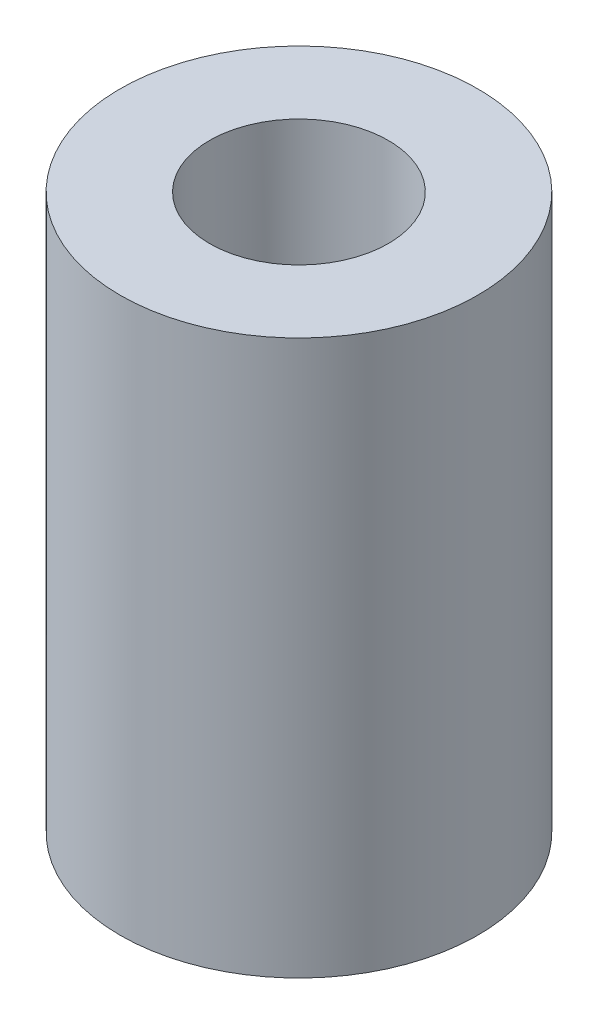
ISO-10303-21;
HEADER;
FILE_DESCRIPTION(('STEP AP214'),'2;1');
FILE_NAME('part.step','',(''),(''),'','','');
FILE_SCHEMA(('AUTOMOTIVE_DESIGN { 1 0 10303 214 1 1 1 1 }'));
ENDSEC;
DATA;
#1=APPLICATION_CONTEXT('core data for automotive mechanical design processes');
#2=APPLICATION_PROTOCOL_DEFINITION('international standard','automotive_design',2000,#1);
#3=PRODUCT_CONTEXT('',#1,'mechanical');
#4=PRODUCT('Part','Part','',(#3));
#5=PRODUCT_RELATED_PRODUCT_CATEGORY('part','',(#4));
#6=PRODUCT_DEFINITION_FORMATION('','',#4);
#7=PRODUCT_DEFINITION_CONTEXT('part definition',#1,'design');
#8=PRODUCT_DEFINITION('design','',#6,#7);
#9=PRODUCT_DEFINITION_SHAPE('','',#8);
#10=(LENGTH_UNIT() NAMED_UNIT(*) SI_UNIT(.MILLI.,.METRE.));
#11=(NAMED_UNIT(*) PLANE_ANGLE_UNIT() SI_UNIT($,.RADIAN.));
#12=(NAMED_UNIT(*) SI_UNIT($,.STERADIAN.) SOLID_ANGLE_UNIT());
#13=UNCERTAINTY_MEASURE_WITH_UNIT(LENGTH_MEASURE(1.E-05),#10,'distance_accuracy_value','');
#14=(GEOMETRIC_REPRESENTATION_CONTEXT(3) GLOBAL_UNCERTAINTY_ASSIGNED_CONTEXT((#13)) GLOBAL_UNIT_ASSIGNED_CONTEXT((#10,
#11,#12)) REPRESENTATION_CONTEXT('',''));
#15=CARTESIAN_POINT('',(0.,0.,0.));
#16=DIRECTION('',(0.,0.,1.));
#17=DIRECTION('',(1.,0.,0.));
#18=AXIS2_PLACEMENT_3D('',#15,#16,#17);
#19=CARTESIAN_POINT('',(0.,15.5,0.));
#20=DIRECTION('',(0.,1.,0.));
#21=DIRECTION('',(0.,0.,1.));
#22=AXIS2_PLACEMENT_3D('',#19,#20,#21);
#23=PLANE('',#22);
#24=CARTESIAN_POINT('',(0.,15.5,0.));
#25=DIRECTION('',(0.,1.,0.));
#26=DIRECTION('',(0.,0.,1.));
#27=AXIS2_PLACEMENT_3D('',#24,#25,#26);
#28=CIRCLE('',#27,5.);
#29=CARTESIAN_POINT('',(0.,15.5,5.));
#30=VERTEX_POINT('',#29);
#31=EDGE_CURVE('E10',#30,#30,#28,.T.);
#32=ORIENTED_EDGE('',*,*,#31,.T.);
#33=EDGE_LOOP('',(#32));
#34=FACE_BOUND('',#33,.T.);
#35=CARTESIAN_POINT('',(0.,15.5,0.));
#36=DIRECTION('',(0.,1.,0.));
#37=DIRECTION('',(0.,0.,1.));
#38=AXIS2_PLACEMENT_3D('',#35,#36,#37);
#39=CIRCLE('',#38,2.5);
#40=CARTESIAN_POINT('',(0.,15.5,2.5));
#41=VERTEX_POINT('',#40);
#42=EDGE_CURVE('E64',#41,#41,#39,.T.);
#43=ORIENTED_EDGE('',*,*,#42,.F.);
#44=EDGE_LOOP('',(#43));
#45=FACE_BOUND('',#44,.T.);
#46=ADVANCED_FACE('F43',(#34,#45),#23,.T.);
#47=CARTESIAN_POINT('',(0.,0.,0.));
#48=DIRECTION('',(0.,1.,0.));
#49=DIRECTION('',(0.,0.,1.));
#50=AXIS2_PLACEMENT_3D('',#47,#48,#49);
#51=PLANE('',#50);
#52=CARTESIAN_POINT('',(0.,0.,0.));
#53=DIRECTION('',(0.,1.,0.));
#54=DIRECTION('',(0.,0.,1.));
#55=AXIS2_PLACEMENT_3D('',#52,#53,#54);
#56=CIRCLE('',#55,5.);
#57=CARTESIAN_POINT('',(0.,0.,5.));
#58=VERTEX_POINT('',#57);
#59=EDGE_CURVE('E58',#58,#58,#56,.T.);
#60=ORIENTED_EDGE('',*,*,#59,.F.);
#61=EDGE_LOOP('',(#60));
#62=FACE_BOUND('',#61,.T.);
#63=CARTESIAN_POINT('',(0.,0.,0.));
#64=DIRECTION('',(0.,1.,0.));
#65=DIRECTION('',(0.,0.,1.));
#66=AXIS2_PLACEMENT_3D('',#63,#64,#65);
#67=CIRCLE('',#66,2.5);
#68=CARTESIAN_POINT('',(0.,0.,2.5));
#69=VERTEX_POINT('',#68);
#70=EDGE_CURVE('E66',#69,#69,#67,.T.);
#71=ORIENTED_EDGE('',*,*,#70,.T.);
#72=EDGE_LOOP('',(#71));
#73=FACE_BOUND('',#72,.T.);
#74=ADVANCED_FACE('F90',(#62,#73),#51,.F.);
#75=CARTESIAN_POINT('',(0.,15.5,0.));
#76=DIRECTION('',(0.,-1.,0.));
#77=DIRECTION('',(0.,0.,-1.));
#78=AXIS2_PLACEMENT_3D('',#75,#76,#77);
#79=CYLINDRICAL_SURFACE('',#78,5.);
#80=CARTESIAN_POINT('',(-4.76969600708473,10.98,-1.5));
#81=CARTESIAN_POINT('',(-4.7696968572698,11.0621945479424,-1.49999897633764));
#82=CARTESIAN_POINT('',(-4.77184390209069,11.144399224144,-1.49322108167142));
#83=CARTESIAN_POINT('',(-4.780165783029,11.3064052495919,-1.46635844446749));
#84=CARTESIAN_POINT('',(-4.78634196493468,11.3862057865015,-1.44626925573578));
#85=CARTESIAN_POINT('',(-4.80196102485632,11.5410347282717,-1.39352753269955));
#86=CARTESIAN_POINT('',(-4.81139846703232,11.6160708296331,-1.36089589394243));
#87=CARTESIAN_POINT('',(-4.83246932547567,11.7596219339953,-1.28406421917929));
#88=CARTESIAN_POINT('',(-4.84410307041019,11.8281359586844,-1.23986245137053));
#89=CARTESIAN_POINT('',(-4.86866862185765,11.9588663905774,-1.13964754141627));
#90=CARTESIAN_POINT('',(-4.88162808311636,12.0208458979463,-1.08333207175807));
#91=CARTESIAN_POINT('',(-4.90714861936757,12.1346379513225,-0.9611362375796));
#92=CARTESIAN_POINT('',(-4.91970964297705,12.1864491904499,-0.895254645461113));
#93=CARTESIAN_POINT('',(-4.94333214579389,12.2794626998333,-0.754111437793691));
#94=CARTESIAN_POINT('',(-4.95435724342404,12.3204234244428,-0.678684021335816));
#95=CARTESIAN_POINT('',(-4.97334435920684,12.3889872590428,-0.521624645369355));
#96=CARTESIAN_POINT('',(-4.98130703789495,12.4165932498574,-0.439994028387913));
#97=CARTESIAN_POINT('',(-4.99307646003589,12.4568800010905,-0.27532385263083));
#98=CARTESIAN_POINT('',(-4.99699557369338,12.4699651276527,-0.192391398953802));
#99=CARTESIAN_POINT('',(-5.00063201501348,12.4821173246464,-0.0254218237493159));
#100=CARTESIAN_POINT('',(-5.00035022521079,12.481187339402,0.0586150620503673));
#101=CARTESIAN_POINT('',(-4.99569603817658,12.465607131457,0.222571156600159));
#102=CARTESIAN_POINT('',(-4.9914542020526,12.4513948061901,0.302536267641341));
#103=CARTESIAN_POINT('',(-4.97951522112593,12.4103686640057,0.458889213442526));
#104=CARTESIAN_POINT('',(-4.97181785750586,12.3835540490573,0.535276821322845));
#105=CARTESIAN_POINT('',(-4.95365220986963,12.3177879765814,0.68334732635128));
#106=CARTESIAN_POINT('',(-4.94315269676706,12.2786987971927,0.754965064694477));
#107=CARTESIAN_POINT('',(-4.92049640648069,12.1896021475718,0.890764673783155));
#108=CARTESIAN_POINT('',(-4.90833923637778,12.1395920870365,0.95494477487213));
#109=CARTESIAN_POINT('',(-4.88311550488165,12.0278022492484,1.0766604815298));
#110=CARTESIAN_POINT('',(-4.87003195321461,11.9656430809703,1.13384458040111));
#111=CARTESIAN_POINT('',(-4.84483979887497,11.8324899821099,1.23707651539823));
#112=CARTESIAN_POINT('',(-4.8327312931702,11.7614951746108,1.28312324482852));
#113=CARTESIAN_POINT('',(-4.81077903197678,11.611760530751,1.3631399533545));
#114=CARTESIAN_POINT('',(-4.80095810695956,11.5329529541371,1.39698989237679));
#115=CARTESIAN_POINT('',(-4.78496392548436,11.3703927915545,1.45083362878413));
#116=CARTESIAN_POINT('',(-4.7787894791583,11.2866418284654,1.4708319464056));
#117=CARTESIAN_POINT('',(-4.77104849541241,11.1199176392607,1.49574770282165));
#118=CARTESIAN_POINT('',(-4.7693187867044,11.037031776106,1.50119946380212));
#119=CARTESIAN_POINT('',(-4.77021192441924,10.8715270999901,1.49835947233062));
#120=CARTESIAN_POINT('',(-4.77283416156589,10.7889082512692,1.4900696437133));
#121=CARTESIAN_POINT('',(-4.78197558554912,10.6285116220291,1.4604576357419));
#122=CARTESIAN_POINT('',(-4.78839176507489,10.5506638357365,1.4394796143128));
#123=CARTESIAN_POINT('',(-4.80429141231227,10.3995983091851,1.3854857774794));
#124=CARTESIAN_POINT('',(-4.81377535359073,10.3263812858594,1.3524681034276));
#125=CARTESIAN_POINT('',(-4.83505835023047,10.1844825359279,1.274318711965));
#126=CARTESIAN_POINT('',(-4.84691271069798,10.1159752790142,1.22888564172729));
#127=CARTESIAN_POINT('',(-4.87148205646987,9.9873618938192,1.12755301600385));
#128=CARTESIAN_POINT('',(-4.88419724730003,9.92725778238721,1.07165095534897));
#129=CARTESIAN_POINT('',(-4.90963633548158,9.81481959418526,0.948455132493599));
#130=CARTESIAN_POINT('',(-4.92234245063004,9.76286437101302,0.880811065857435));
#131=CARTESIAN_POINT('',(-4.9458485174865,9.67103329897225,0.73746178459025));
#132=CARTESIAN_POINT('',(-4.95664856384717,9.63115685021854,0.661756970543945));
#133=CARTESIAN_POINT('',(-4.97505970474957,9.56499996943171,0.504935504705223));
#134=CARTESIAN_POINT('',(-4.98269453424965,9.53861798384102,0.423864622037841));
#135=CARTESIAN_POINT('',(-4.99401979596827,9.49993908110958,0.25816996650459));
#136=CARTESIAN_POINT('',(-4.9977113567088,9.48763813405158,0.173547217354765));
#137=CARTESIAN_POINT('',(-5.00066544081399,9.4777769559455,0.00665215388274474));
#138=CARTESIAN_POINT('',(-5.00009305111322,9.47966730459217,-0.0755851790862047));
#139=CARTESIAN_POINT('',(-4.99497264465036,9.49682163249912,-0.238519481164402));
#140=CARTESIAN_POINT('',(-4.99042485330462,9.51208485348044,-0.319216537346527));
#141=CARTESIAN_POINT('',(-4.97791168358326,9.55521166139962,-0.475935813041356));
#142=CARTESIAN_POINT('',(-4.96998352900866,9.58293818064901,-0.55199892735139));
#143=CARTESIAN_POINT('',(-4.9515294303945,9.65008191450719,-0.698433237752051));
#144=CARTESIAN_POINT('',(-4.94100305949946,9.68950105028619,-0.768803496050578));
#145=CARTESIAN_POINT('',(-4.91803965828228,9.78037345743003,-0.904301892420562));
#146=CARTESIAN_POINT('',(-4.90555226923559,9.83217143000076,-0.969190250076765));
#147=CARTESIAN_POINT('',(-4.88023537212334,9.9457103883328,-1.08953757134594));
#148=CARTESIAN_POINT('',(-4.86740576641079,10.0074542378982,-1.14499380960193));
#149=CARTESIAN_POINT('',(-4.84240680631319,10.1413407783105,-1.24656269394549));
#150=CARTESIAN_POINT('',(-4.83026852693485,10.2137385533904,-1.29234759757956));
#151=CARTESIAN_POINT('',(-4.80852547508793,10.365555174161,-1.37104313528776));
#152=CARTESIAN_POINT('',(-4.79891948596955,10.4449706236012,-1.40395995557288));
#153=CARTESIAN_POINT('',(-4.78427816717594,10.5997404316063,-1.4530194253295));
#154=CARTESIAN_POINT('',(-4.7788615484052,10.674608646931,-1.47058859011232));
#155=CARTESIAN_POINT('',(-4.77157042597167,10.8263152224958,-1.49407818835144));
#156=CARTESIAN_POINT('',(-4.7696952122143,10.9031531846452,-1.50000095706095));
#157=CARTESIAN_POINT('',(-4.76969600708473,10.98,-1.5));
#158=B_SPLINE_CURVE_WITH_KNOTS('',3,(#80,#81,#82,#83,#84,#85,#86,#87,#88,#89,#90,#91,#92,#93,
#94,#95,#96,#97,#98,#99,#100,#101,#102,#103,#104,#105,#106,#107,#108,#109,#110,#111,#112,#113,
#114,#115,#116,#117,#118,#119,#120,#121,#122,#123,#124,#125,#126,#127,#128,#129,#130,#131,#132,
#133,#134,#135,#136,#137,#138,#139,#140,#141,#142,#143,#144,#145,#146,#147,#148,#149,#150,#151,
#152,#153,#154,#155,#156,#157),.UNSPECIFIED.,.T.,.F.,(4,2,2,2,2,2,2,2,2,2,2,2,2,2,2,2,2,2,2,2,2,
2,2,2,2,2,2,2,2,2,2,2,2,2,2,2,2,2,4),(0.,0.246300165915542,0.492682641688999,0.738656414466194,
0.9846670253701,1.23773150007984,1.49082847871273,1.74915939273644,2.00743455587877,
2.25832140149558,2.5091555410144,2.7520012599088,2.99486235890376,3.24055209335676,
3.4863001659083,3.74152147023278,3.99676812491863,4.25446238246266,4.51207250628411,
4.76008080790309,5.00805439107387,5.24958594938817,5.49115481045787,5.73920731809388,
5.98731925928923,6.24479506100602,6.50225807324202,6.75775391814325,7.01317662321682,
7.2587630391122,7.50433553047754,7.74727096872219,7.99024634491378,8.24099627054488,
8.4918185262989,8.75011639669147,9.00828993963944,9.23861153857448,9.4688869503356),.UNSPECIFIED.);
#159=CARTESIAN_POINT('',(-4.76969600708473,10.98,-1.5));
#160=VERTEX_POINT('',#159);
#161=EDGE_CURVE('E70',#160,#160,#158,.T.);
#162=ORIENTED_EDGE('',*,*,#161,.T.);
#163=EDGE_LOOP('',(#162));
#164=FACE_BOUND('',#163,.T.);
#165=ORIENTED_EDGE('',*,*,#31,.F.);
#166=EDGE_LOOP('',(#165));
#167=FACE_BOUND('',#166,.T.);
#168=ORIENTED_EDGE('',*,*,#59,.T.);
#169=EDGE_LOOP('',(#168));
#170=FACE_BOUND('',#169,.T.);
#171=ADVANCED_FACE('F45',(#164,#167,#170),#79,.T.);
#172=CARTESIAN_POINT('',(0.,15.5,0.));
#173=DIRECTION('',(0.,-1.,0.));
#174=DIRECTION('',(0.,0.,-1.));
#175=AXIS2_PLACEMENT_3D('',#172,#173,#174);
#176=CYLINDRICAL_SURFACE('',#175,2.5);
#177=CARTESIAN_POINT('',(-2.,10.98,-1.5));
#178=CARTESIAN_POINT('',(-1.99999416642511,11.0554789752896,-1.50000404108592));
#179=CARTESIAN_POINT('',(-2.00433633903481,11.1309384340798,-1.49426852824013));
#180=CARTESIAN_POINT('',(-2.02092590613883,11.2793239039622,-1.47174965152787));
#181=CARTESIAN_POINT('',(-2.03318155043097,11.3522471873851,-1.45495475788936));
#182=CARTESIAN_POINT('',(-2.0636233903473,11.4930836416773,-1.41143486335795));
#183=CARTESIAN_POINT('',(-2.0817666618312,11.5610288380353,-1.3847815450315));
#184=CARTESIAN_POINT('',(-2.12185904995836,11.6914374533679,-1.32252909283019));
#185=CARTESIAN_POINT('',(-2.14380930122416,11.7538992296951,-1.28692729054693));
#186=CARTESIAN_POINT('',(-2.19228594587542,11.8799490166641,-1.20271292747644));
#187=CARTESIAN_POINT('',(-2.21904371037662,11.9427409571239,-1.15304179435289));
#188=CARTESIAN_POINT('',(-2.2722622943106,12.0597647627418,-1.04426801309985));
#189=CARTESIAN_POINT('',(-2.29872287517103,12.1139901516708,-0.985158296729614));
#190=CARTESIAN_POINT('',(-2.35175567858734,12.2181338097097,-0.851442367411703));
#191=CARTESIAN_POINT('',(-2.37803133577818,12.2669544636697,-0.775851995162549));
#192=CARTESIAN_POINT('',(-2.42443786983179,12.3508097224444,-0.61565422827166));
#193=CARTESIAN_POINT('',(-2.44457437988735,12.3858569741227,-0.531055196626332));
#194=CARTESIAN_POINT('',(-2.4747098780044,12.4375959228126,-0.363771406742668));
#195=CARTESIAN_POINT('',(-2.4854930393917,12.4557203609673,-0.281674698130917));
#196=CARTESIAN_POINT('',(-2.49874939277545,12.4779428028631,-0.114970509382709));
#197=CARTESIAN_POINT('',(-2.50123038813307,12.4820539780001,-0.0303654624001545));
#198=CARTESIAN_POINT('',(-2.49783372711539,12.4763862526575,0.127637283737309));
#199=CARTESIAN_POINT('',(-2.49295437513726,12.4682664738307,0.201123832865633));
#200=CARTESIAN_POINT('',(-2.47707997553857,12.4415202043519,0.345464269151767));
#201=CARTESIAN_POINT('',(-2.46608447529309,12.4228929360928,0.4163179610512));
#202=CARTESIAN_POINT('',(-2.43884907201719,12.3758344372962,0.554056780469078));
#203=CARTESIAN_POINT('',(-2.42257910450824,12.347346938861,0.620916491037616));
#204=CARTESIAN_POINT('',(-2.38609637638748,12.2816153837745,0.74898866011561));
#205=CARTESIAN_POINT('',(-2.36588259201812,12.244369052941,0.81019964620801));
#206=CARTESIAN_POINT('',(-2.32037925976363,12.1571609071955,0.933074267143198));
#207=CARTESIAN_POINT('',(-2.2947718295215,12.1062116882643,0.993918663198192));
#208=CARTESIAN_POINT('',(-2.24255554245601,11.9955958821398,1.10671465909274));
#209=CARTESIAN_POINT('',(-2.21594536703375,11.9359174965255,1.1586540130834));
#210=CARTESIAN_POINT('',(-2.16111075123946,11.8013465938364,1.25824837767417));
#211=CARTESIAN_POINT('',(-2.13305661385124,11.7254924234605,1.30470933188632));
#212=CARTESIAN_POINT('',(-2.08250879557267,11.5652937683634,1.38397217194232));
#213=CARTESIAN_POINT('',(-2.06000490298821,11.4809652838744,1.41679921962189));
#214=CARTESIAN_POINT('',(-2.02895865196731,11.3276063681047,1.46077497064842));
#215=CARTESIAN_POINT('',(-2.01833888618316,11.2599593677034,1.47527903312665));
#216=CARTESIAN_POINT('',(-2.00392150777558,11.1226263897005,1.49480872755284));
#217=CARTESIAN_POINT('',(-2.00011596115116,11.0529428795154,1.49984538302907));
#218=CARTESIAN_POINT('',(-1.99988914321323,10.9134483175643,1.50014781114183));
#219=CARTESIAN_POINT('',(-2.00347810223984,10.8436372227848,1.49540004697659));
#220=CARTESIAN_POINT('',(-2.01751520788652,10.7060126562514,1.47640290574941));
#221=CARTESIAN_POINT('',(-2.02796877613213,10.6382008077597,1.46214601830139));
#222=CARTESIAN_POINT('',(-2.054317683331,10.5062854205202,1.42488312618657));
#223=CARTESIAN_POINT('',(-2.07020622092812,10.4421773634678,1.40188805257362));
#224=CARTESIAN_POINT('',(-2.10571539417587,10.3185222842698,1.34796261057072));
#225=CARTESIAN_POINT('',(-2.12533743689999,10.258976993634,1.31702924888212));
#226=CARTESIAN_POINT('',(-2.17036819177736,10.1347599174878,1.24167439558512));
#227=CARTESIAN_POINT('',(-2.19618239397369,10.0710991649034,1.19582663060303));
#228=CARTESIAN_POINT('',(-2.2482175480362,9.95171451515054,1.09487395518701));
#229=CARTESIAN_POINT('',(-2.27443886711455,9.89599830783088,1.03976018672402));
#230=CARTESIAN_POINT('',(-2.32835625910913,9.78677599264957,0.913274837212769));
#231=CARTESIAN_POINT('',(-2.3558007587587,9.73449927339416,0.840721108780194));
#232=CARTESIAN_POINT('',(-2.40537639133459,9.64309722316335,0.686103100868023));
#233=CARTESIAN_POINT('',(-2.4275110444941,9.60396317215908,0.604045176134706));
#234=CARTESIAN_POINT('',(-2.46252280092775,9.54313179656864,0.438840232972142));
#235=CARTESIAN_POINT('',(-2.47595588067329,9.5203737722089,0.356205963651262));
#236=CARTESIAN_POINT('',(-2.494407389061,9.48928539715374,0.18738306389086));
#237=CARTESIAN_POINT('',(-2.49943534582737,9.48093870928238,0.101198571781972));
#238=CARTESIAN_POINT('',(-2.50040600461976,9.47932539141407,-0.0598120232009814));
#239=CARTESIAN_POINT('',(-2.49747057186327,9.48419666543697,-0.134620583589704));
#240=CARTESIAN_POINT('',(-2.48512948412096,9.50489382438161,-0.282148755978771));
#241=CARTESIAN_POINT('',(-2.47572375706639,9.5207198313216,-0.354868344701911));
#242=CARTESIAN_POINT('',(-2.45149427526962,9.56221957158378,-0.495145481978794));
#243=CARTESIAN_POINT('',(-2.43675966858906,9.58773159612924,-0.562767032608828));
#244=CARTESIAN_POINT('',(-2.40303337447155,9.64764059455475,-0.692781971999982));
#245=CARTESIAN_POINT('',(-2.38404073252268,9.6820395608596,-0.755174184199829));
#246=CARTESIAN_POINT('',(-2.34093432659381,9.76292519656876,-0.880263645295945));
#247=CARTESIAN_POINT('',(-2.31648844639149,9.81031870901687,-0.942258690439938));
#248=CARTESIAN_POINT('',(-2.26601907350661,9.91375303371772,-1.05789751536306));
#249=CARTESIAN_POINT('',(-2.23999385274509,9.96980342560791,-1.11153190956916));
#250=CARTESIAN_POINT('',(-2.18528165666205,10.0972855621777,-1.2159097535057));
#251=CARTESIAN_POINT('',(-2.15667566270901,10.1697664861655,-1.26542406663367));
#252=CARTESIAN_POINT('',(-2.10376464485145,10.3234848527665,-1.35156817210325));
#253=CARTESIAN_POINT('',(-2.07945738811052,10.4047177139814,-1.38820466322661));
#254=CARTESIAN_POINT('',(-2.0408000304796,10.5670642851372,-1.44437116535132));
#255=CARTESIAN_POINT('',(-2.02577665830138,10.6475952359612,-1.46509526060187));
#256=CARTESIAN_POINT('',(-2.00539032320036,10.8120973947037,-1.49289268240426));
#257=CARTESIAN_POINT('',(-2.00000648744643,10.8960607657587,-1.49999550595837));
#258=CARTESIAN_POINT('',(-2.,10.98,-1.5));
#259=B_SPLINE_CURVE_WITH_KNOTS('',3,(#177,#178,#179,#180,#181,#182,#183,#184,#185,#186,#187,
#188,#189,#190,#191,#192,#193,#194,#195,#196,#197,#198,#199,#200,#201,#202,#203,#204,#205,#206,
#207,#208,#209,#210,#211,#212,#213,#214,#215,#216,#217,#218,#219,#220,#221,#222,#223,#224,#225,
#226,#227,#228,#229,#230,#231,#232,#233,#234,#235,#236,#237,#238,#239,#240,#241,#242,#243,#244,
#245,#246,#247,#248,#249,#250,#251,#252,#253,#254,#255,#256,#257,#258),.UNSPECIFIED.,.T.,.F.,(4,
2,2,2,2,2,2,2,2,2,2,2,2,2,2,2,2,2,2,2,2,2,2,2,2,2,2,2,2,2,2,2,2,2,2,2,2,2,2,2,4),(0.,
0.226085249493392,0.452406574330769,0.677113624991876,0.901887762215931,1.15414462390001,
1.40659128601843,1.68630157736223,1.9657544327122,2.21853330858497,2.47107452602766,
2.69230130543181,2.91354445887944,3.13607155036376,3.35865648368878,3.60782810055849,
3.85733966656908,4.13576671140276,4.41367760154768,4.62276298054683,4.83160475643976,
5.04073566011181,5.25003193304128,5.45906724365495,5.6681814915466,5.91499438482002,
6.16204457978454,6.44121828011588,6.72020638384847,6.97891479383337,7.23732973022726,
7.46129321849399,7.68525920139648,7.90563970188756,8.12606965394584,8.37042963549487,
8.61506198741955,8.89071695766604,9.16622832484805,9.41820120134354,9.66962780912277),.UNSPECIFIED.);
#260=CARTESIAN_POINT('',(-2.,10.98,-1.5));
#261=VERTEX_POINT('',#260);
#262=EDGE_CURVE('E48',#261,#261,#259,.T.);
#263=ORIENTED_EDGE('',*,*,#262,.F.);
#264=EDGE_LOOP('',(#263));
#265=FACE_BOUND('',#264,.T.);
#266=ORIENTED_EDGE('',*,*,#42,.T.);
#267=EDGE_LOOP('',(#266));
#268=FACE_BOUND('',#267,.T.);
#269=ORIENTED_EDGE('',*,*,#70,.F.);
#270=EDGE_LOOP('',(#269));
#271=FACE_BOUND('',#270,.T.);
#272=ADVANCED_FACE('F82',(#265,#268,#271),#176,.F.);
#273=CARTESIAN_POINT('',(-15.5,10.98,0.));
#274=DIRECTION('',(1.,0.,0.));
#275=DIRECTION('',(0.,0.,-1.));
#276=AXIS2_PLACEMENT_3D('',#273,#274,#275);
#277=CYLINDRICAL_SURFACE('',#276,1.5);
#278=ORIENTED_EDGE('',*,*,#262,.T.);
#279=EDGE_LOOP('',(#278));
#280=FACE_BOUND('',#279,.T.);
#281=ORIENTED_EDGE('',*,*,#161,.F.);
#282=EDGE_LOOP('',(#281));
#283=FACE_BOUND('',#282,.T.);
#284=ADVANCED_FACE('F79',(#280,#283),#277,.F.);
#285=CLOSED_SHELL('',(#46,#74,#171,#272,#284));
#286=MANIFOLD_SOLID_BREP('B2',#285);
#287=ADVANCED_BREP_SHAPE_REPRESENTATION('',(#18,#286),#14);
#288=SHAPE_DEFINITION_REPRESENTATION(#9,#287);
ENDSEC;
END-ISO-10303-21;
